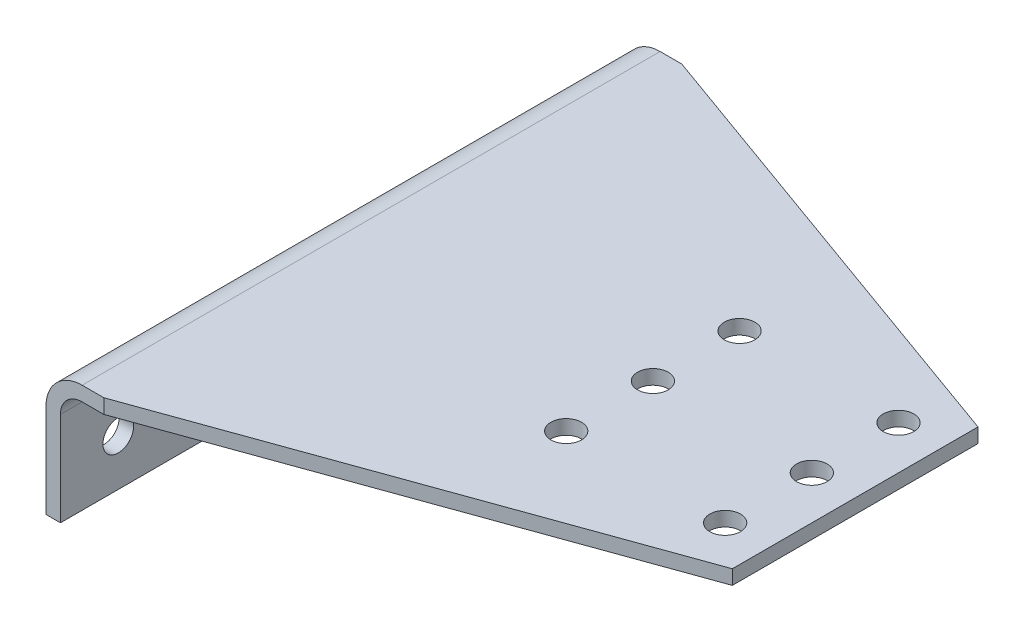
ISO-10303-21;
HEADER;
FILE_DESCRIPTION(('STEP AP214'),'2;1');
FILE_NAME('part.step','',(''),(''),'','','');
FILE_SCHEMA(('AUTOMOTIVE_DESIGN { 1 0 10303 214 1 1 1 1 }'));
ENDSEC;
DATA;
#1=APPLICATION_CONTEXT('core data for automotive mechanical design processes');
#2=APPLICATION_PROTOCOL_DEFINITION('international standard','automotive_design',2000,#1);
#3=PRODUCT_CONTEXT('',#1,'mechanical');
#4=PRODUCT('Part','Part','',(#3));
#5=PRODUCT_RELATED_PRODUCT_CATEGORY('part','',(#4));
#6=PRODUCT_DEFINITION_FORMATION('','',#4);
#7=PRODUCT_DEFINITION_CONTEXT('part definition',#1,'design');
#8=PRODUCT_DEFINITION('design','',#6,#7);
#9=PRODUCT_DEFINITION_SHAPE('','',#8);
#10=(LENGTH_UNIT() NAMED_UNIT(*) SI_UNIT(.MILLI.,.METRE.));
#11=(NAMED_UNIT(*) PLANE_ANGLE_UNIT() SI_UNIT($,.RADIAN.));
#12=(NAMED_UNIT(*) SI_UNIT($,.STERADIAN.) SOLID_ANGLE_UNIT());
#13=UNCERTAINTY_MEASURE_WITH_UNIT(LENGTH_MEASURE(1.E-05),#10,'distance_accuracy_value','');
#14=(GEOMETRIC_REPRESENTATION_CONTEXT(3) GLOBAL_UNCERTAINTY_ASSIGNED_CONTEXT((#13)) GLOBAL_UNIT_ASSIGNED_CONTEXT((#10,
#11,#12)) REPRESENTATION_CONTEXT('',''));
#15=CARTESIAN_POINT('',(0.,0.,0.));
#16=DIRECTION('',(0.,0.,1.));
#17=DIRECTION('',(1.,0.,0.));
#18=AXIS2_PLACEMENT_3D('',#15,#16,#17);
#19=CARTESIAN_POINT('',(6.34999999999997,-57.15,-127.000000000001));
#20=DIRECTION('',(1.,0.,0.));
#21=DIRECTION('',(0.,1.,0.));
#22=AXIS2_PLACEMENT_3D('',#19,#20,#21);
#23=PLANE('',#22);
#24=CARTESIAN_POINT('',(6.34999999999997,-36.5125,50.8000000000006));
#25=DIRECTION('',(1.,0.,0.));
#26=DIRECTION('',(0.,1.,0.));
#27=AXIS2_PLACEMENT_3D('',#24,#25,#26);
#28=CIRCLE('',#27,6.731);
#29=CARTESIAN_POINT('',(6.34999999999997,-29.7815,50.8000000000006));
#30=VERTEX_POINT('',#29);
#31=EDGE_CURVE('E361',#30,#30,#28,.F.);
#32=ORIENTED_EDGE('',*,*,#31,.T.);
#33=EDGE_LOOP('',(#32));
#34=FACE_BOUND('',#33,.T.);
#35=CARTESIAN_POINT('',(6.34999999999997,-36.5125,-101.599999999999));
#36=DIRECTION('',(1.,0.,0.));
#37=DIRECTION('',(0.,1.,0.));
#38=AXIS2_PLACEMENT_3D('',#35,#36,#37);
#39=CIRCLE('',#38,6.73099999999998);
#40=CARTESIAN_POINT('',(6.34999999999997,-29.7815,-101.599999999999));
#41=VERTEX_POINT('',#40);
#42=EDGE_CURVE('E372',#41,#41,#39,.F.);
#43=ORIENTED_EDGE('',*,*,#42,.T.);
#44=EDGE_LOOP('',(#43));
#45=FACE_BOUND('',#44,.T.);
#46=DIRECTION('',(0.,1.,0.));
#47=VECTOR('',#46,1.);
#48=CARTESIAN_POINT('',(6.34999999999997,-57.15,127.000000000001));
#49=LINE('',#48,#47);
#50=CARTESIAN_POINT('',(6.34999999999997,-57.15,127.000000000001));
#51=VERTEX_POINT('',#50);
#52=CARTESIAN_POINT('',(6.34999999999997,-15.875,127.000000000001));
#53=VERTEX_POINT('',#52);
#54=EDGE_CURVE('E198',#51,#53,#49,.T.);
#55=ORIENTED_EDGE('',*,*,#54,.F.);
#56=DIRECTION('',(0.,0.,1.));
#57=VECTOR('',#56,1.);
#58=CARTESIAN_POINT('',(6.34999999999997,-57.15,-127.000000000001));
#59=LINE('',#58,#57);
#60=CARTESIAN_POINT('',(6.34999999999997,-57.15,-127.000000000001));
#61=VERTEX_POINT('',#60);
#62=EDGE_CURVE('E228',#61,#51,#59,.T.);
#63=ORIENTED_EDGE('',*,*,#62,.F.);
#64=DIRECTION('',(0.,1.,0.));
#65=VECTOR('',#64,1.);
#66=CARTESIAN_POINT('',(6.34999999999997,-57.15,-127.000000000001));
#67=LINE('',#66,#65);
#68=CARTESIAN_POINT('',(6.34999999999997,-15.875,-127.000000000001));
#69=VERTEX_POINT('',#68);
#70=EDGE_CURVE('E218',#61,#69,#67,.T.);
#71=ORIENTED_EDGE('',*,*,#70,.T.);
#72=DIRECTION('',(0.,0.,1.));
#73=VECTOR('',#72,1.);
#74=CARTESIAN_POINT('',(6.34999999999997,-15.875,-127.000000000001));
#75=LINE('',#74,#73);
#76=EDGE_CURVE('E226',#69,#53,#75,.T.);
#77=ORIENTED_EDGE('',*,*,#76,.T.);
#78=EDGE_LOOP('',(#55,#63,#71,#77));
#79=FACE_BOUND('',#78,.T.);
#80=CARTESIAN_POINT('',(6.34999999999997,-36.5125,0.));
#81=DIRECTION('',(1.,0.,0.));
#82=DIRECTION('',(0.,1.,0.));
#83=AXIS2_PLACEMENT_3D('',#80,#81,#82);
#84=CIRCLE('',#83,6.731);
#85=CARTESIAN_POINT('',(6.34999999999997,-29.7815,0.));
#86=VERTEX_POINT('',#85);
#87=EDGE_CURVE('E171',#86,#86,#84,.F.);
#88=ORIENTED_EDGE('',*,*,#87,.T.);
#89=EDGE_LOOP('',(#88));
#90=FACE_BOUND('',#89,.T.);
#91=CARTESIAN_POINT('',(6.34999999999997,-36.5125,101.599999999999));
#92=DIRECTION('',(1.,0.,0.));
#93=DIRECTION('',(0.,1.,0.));
#94=AXIS2_PLACEMENT_3D('',#91,#92,#93);
#95=CIRCLE('',#94,6.731);
#96=CARTESIAN_POINT('',(6.34999999999997,-29.7815,101.599999999999));
#97=VERTEX_POINT('',#96);
#98=EDGE_CURVE('E366',#97,#97,#95,.F.);
#99=ORIENTED_EDGE('',*,*,#98,.T.);
#100=EDGE_LOOP('',(#99));
#101=FACE_BOUND('',#100,.T.);
#102=CARTESIAN_POINT('',(6.34999999999997,-36.5125,-50.8000000000006));
#103=DIRECTION('',(1.,0.,0.));
#104=DIRECTION('',(0.,1.,0.));
#105=AXIS2_PLACEMENT_3D('',#102,#103,#104);
#106=CIRCLE('',#105,6.731);
#107=CARTESIAN_POINT('',(6.34999999999997,-29.7815,-50.8000000000006));
#108=VERTEX_POINT('',#107);
#109=EDGE_CURVE('E350',#108,#108,#106,.F.);
#110=ORIENTED_EDGE('',*,*,#109,.T.);
#111=EDGE_LOOP('',(#110));
#112=FACE_BOUND('',#111,.T.);
#113=ADVANCED_FACE('F34',(#34,#45,#79,#90,#101,#112),#23,.T.);
#114=CARTESIAN_POINT('',(0.,-15.875,-127.000000000001));
#115=DIRECTION('',(-1.,0.,0.));
#116=DIRECTION('',(0.,-1.,0.));
#117=AXIS2_PLACEMENT_3D('',#114,#115,#116);
#118=PLANE('',#117);
#119=CARTESIAN_POINT('',(0.,-36.5125,50.8000000000006));
#120=DIRECTION('',(1.,0.,0.));
#121=DIRECTION('',(0.,0.,-1.));
#122=AXIS2_PLACEMENT_3D('',#119,#120,#121);
#123=CIRCLE('',#122,6.731);
#124=CARTESIAN_POINT('',(0.,-36.5125,44.0690000000006));
#125=VERTEX_POINT('',#124);
#126=EDGE_CURVE('E356',#125,#125,#123,.T.);
#127=ORIENTED_EDGE('',*,*,#126,.T.);
#128=EDGE_LOOP('',(#127));
#129=FACE_BOUND('',#128,.T.);
#130=CARTESIAN_POINT('',(0.,-36.5125,-101.599999999999));
#131=DIRECTION('',(1.,0.,0.));
#132=DIRECTION('',(0.,0.,-1.));
#133=AXIS2_PLACEMENT_3D('',#130,#131,#132);
#134=CIRCLE('',#133,6.73099999999998);
#135=CARTESIAN_POINT('',(0.,-36.5125,-108.330999999999));
#136=VERTEX_POINT('',#135);
#137=EDGE_CURVE('E369',#136,#136,#134,.T.);
#138=ORIENTED_EDGE('',*,*,#137,.T.);
#139=EDGE_LOOP('',(#138));
#140=FACE_BOUND('',#139,.T.);
#141=DIRECTION('',(0.,-1.,0.));
#142=VECTOR('',#141,1.);
#143=CARTESIAN_POINT('',(0.,-15.875,127.000000000001));
#144=LINE('',#143,#142);
#145=CARTESIAN_POINT('',(0.,-15.875,127.000000000001));
#146=VERTEX_POINT('',#145);
#147=CARTESIAN_POINT('',(0.,-57.15,127.000000000001));
#148=VERTEX_POINT('',#147);
#149=EDGE_CURVE('E192',#146,#148,#144,.T.);
#150=ORIENTED_EDGE('',*,*,#149,.F.);
#151=DIRECTION('',(0.,0.,1.));
#152=VECTOR('',#151,1.);
#153=CARTESIAN_POINT('',(0.,-15.875,-127.000000000001));
#154=LINE('',#153,#152);
#155=CARTESIAN_POINT('',(0.,-15.875,-127.000000000001));
#156=VERTEX_POINT('',#155);
#157=EDGE_CURVE('E135',#156,#146,#154,.T.);
#158=ORIENTED_EDGE('',*,*,#157,.F.);
#159=DIRECTION('',(0.,-1.,0.));
#160=VECTOR('',#159,1.);
#161=CARTESIAN_POINT('',(0.,-15.875,-127.000000000001));
#162=LINE('',#161,#160);
#163=CARTESIAN_POINT('',(0.,-57.15,-127.000000000001));
#164=VERTEX_POINT('',#163);
#165=EDGE_CURVE('E212',#156,#164,#162,.T.);
#166=ORIENTED_EDGE('',*,*,#165,.T.);
#167=DIRECTION('',(0.,0.,1.));
#168=VECTOR('',#167,1.);
#169=CARTESIAN_POINT('',(0.,-57.15,-127.000000000001));
#170=LINE('',#169,#168);
#171=EDGE_CURVE('E230',#164,#148,#170,.T.);
#172=ORIENTED_EDGE('',*,*,#171,.T.);
#173=EDGE_LOOP('',(#150,#158,#166,#172));
#174=FACE_BOUND('',#173,.T.);
#175=CARTESIAN_POINT('',(0.,-36.5125,0.));
#176=DIRECTION('',(1.,0.,0.));
#177=DIRECTION('',(0.,0.,-1.));
#178=AXIS2_PLACEMENT_3D('',#175,#176,#177);
#179=CIRCLE('',#178,6.731);
#180=CARTESIAN_POINT('',(0.,-36.5125,-6.731));
#181=VERTEX_POINT('',#180);
#182=EDGE_CURVE('E374',#181,#181,#179,.T.);
#183=ORIENTED_EDGE('',*,*,#182,.T.);
#184=EDGE_LOOP('',(#183));
#185=FACE_BOUND('',#184,.T.);
#186=CARTESIAN_POINT('',(0.,-36.5125,101.599999999999));
#187=DIRECTION('',(1.,0.,0.));
#188=DIRECTION('',(0.,0.,-1.));
#189=AXIS2_PLACEMENT_3D('',#186,#187,#188);
#190=CIRCLE('',#189,6.731);
#191=CARTESIAN_POINT('',(0.,-36.5125,94.8689999999995));
#192=VERTEX_POINT('',#191);
#193=EDGE_CURVE('E363',#192,#192,#190,.T.);
#194=ORIENTED_EDGE('',*,*,#193,.T.);
#195=EDGE_LOOP('',(#194));
#196=FACE_BOUND('',#195,.T.);
#197=CARTESIAN_POINT('',(0.,-36.5125,-50.8000000000006));
#198=DIRECTION('',(1.,0.,0.));
#199=DIRECTION('',(0.,0.,-1.));
#200=AXIS2_PLACEMENT_3D('',#197,#198,#199);
#201=CIRCLE('',#200,6.731);
#202=CARTESIAN_POINT('',(0.,-36.5125,-57.5310000000006));
#203=VERTEX_POINT('',#202);
#204=EDGE_CURVE('E353',#203,#203,#201,.T.);
#205=ORIENTED_EDGE('',*,*,#204,.T.);
#206=EDGE_LOOP('',(#205));
#207=FACE_BOUND('',#206,.T.);
#208=ADVANCED_FACE('F239',(#129,#140,#174,#185,#196,#207),#118,.T.);
#209=CARTESIAN_POINT('',(15.875,-6.34999999999999,-127.000000000001));
#210=DIRECTION('',(0.,-1.,0.));
#211=DIRECTION('',(1.,0.,0.));
#212=AXIS2_PLACEMENT_3D('',#209,#210,#211);
#213=PLANE('',#212);
#214=CARTESIAN_POINT('',(139.700000000001,-6.34999999999997,38.1));
#215=DIRECTION('',(0.,-1.,0.));
#216=DIRECTION('',(1.,0.,0.));
#217=AXIS2_PLACEMENT_3D('',#214,#215,#216);
#218=CIRCLE('',#217,6.73099999999998);
#219=CARTESIAN_POINT('',(146.431000000001,-6.34999999999997,38.1));
#220=VERTEX_POINT('',#219);
#221=EDGE_CURVE('E158',#220,#220,#218,.F.);
#222=ORIENTED_EDGE('',*,*,#221,.T.);
#223=EDGE_LOOP('',(#222));
#224=FACE_BOUND('',#223,.T.);
#225=CARTESIAN_POINT('',(139.700000000001,-6.34999999999997,0.));
#226=DIRECTION('',(0.,-1.,0.));
#227=DIRECTION('',(1.,0.,0.));
#228=AXIS2_PLACEMENT_3D('',#225,#226,#227);
#229=CIRCLE('',#228,6.73099999999998);
#230=CARTESIAN_POINT('',(146.431000000001,-6.34999999999997,0.));
#231=VERTEX_POINT('',#230);
#232=EDGE_CURVE('E151',#231,#231,#229,.F.);
#233=ORIENTED_EDGE('',*,*,#232,.T.);
#234=EDGE_LOOP('',(#233));
#235=FACE_BOUND('',#234,.T.);
#236=CARTESIAN_POINT('',(209.550000000001,-6.34999999999998,-38.1));
#237=DIRECTION('',(0.,-1.,0.));
#238=DIRECTION('',(1.,0.,0.));
#239=AXIS2_PLACEMENT_3D('',#236,#237,#238);
#240=CIRCLE('',#239,6.73099999999998);
#241=CARTESIAN_POINT('',(216.281000000001,-6.34999999999998,-38.1));
#242=VERTEX_POINT('',#241);
#243=EDGE_CURVE('E118',#242,#242,#240,.F.);
#244=ORIENTED_EDGE('',*,*,#243,.T.);
#245=EDGE_LOOP('',(#244));
#246=FACE_BOUND('',#245,.T.);
#247=DIRECTION('',(0.,0.,1.));
#248=VECTOR('',#247,1.);
#249=CARTESIAN_POINT('',(228.600000000001,-6.35000000000003,-127.000000000001));
#250=LINE('',#249,#248);
#251=CARTESIAN_POINT('',(228.600000000001,-6.35,-53.9749999999994));
#252=VERTEX_POINT('',#251);
#253=CARTESIAN_POINT('',(228.600000000001,-6.35,53.9749999999994));
#254=VERTEX_POINT('',#253);
#255=EDGE_CURVE('E142',#252,#254,#250,.T.);
#256=ORIENTED_EDGE('',*,*,#255,.T.);
#257=DIRECTION('',(-0.941074716280077,0.,0.338198726163152));
#258=VECTOR('',#257,1.);
#259=CARTESIAN_POINT('',(97.8051027027033,-6.35000000000003,100.979416216216));
#260=LINE('',#259,#258);
#261=CARTESIAN_POINT('',(25.4,-6.34999999999997,127.000000000001));
#262=VERTEX_POINT('',#261);
#263=EDGE_CURVE('E113',#254,#262,#260,.T.);
#264=ORIENTED_EDGE('',*,*,#263,.T.);
#265=DIRECTION('',(1.,0.,0.));
#266=VECTOR('',#265,1.);
#267=CARTESIAN_POINT('',(15.875,-6.34999999999999,127.000000000001));
#268=LINE('',#267,#266);
#269=CARTESIAN_POINT('',(15.875,-6.34999999999999,127.000000000001));
#270=VERTEX_POINT('',#269);
#271=EDGE_CURVE('E204',#270,#262,#268,.T.);
#272=ORIENTED_EDGE('',*,*,#271,.F.);
#273=DIRECTION('',(0.,0.,1.));
#274=VECTOR('',#273,1.);
#275=CARTESIAN_POINT('',(15.875,-6.34999999999999,-127.000000000001));
#276=LINE('',#275,#274);
#277=CARTESIAN_POINT('',(15.875,-6.34999999999999,-127.000000000001));
#278=VERTEX_POINT('',#277);
#279=EDGE_CURVE('E224',#278,#270,#276,.T.);
#280=ORIENTED_EDGE('',*,*,#279,.F.);
#281=DIRECTION('',(1.,0.,0.));
#282=VECTOR('',#281,1.);
#283=CARTESIAN_POINT('',(15.875,-6.34999999999999,-127.000000000001));
#284=LINE('',#283,#282);
#285=CARTESIAN_POINT('',(25.4,-6.35,-127.000000000001));
#286=VERTEX_POINT('',#285);
#287=EDGE_CURVE('E133',#278,#286,#284,.T.);
#288=ORIENTED_EDGE('',*,*,#287,.T.);
#289=DIRECTION('',(0.941074716280077,0.,0.338198726163152));
#290=VECTOR('',#289,1.);
#291=CARTESIAN_POINT('',(16.9644540540541,-6.34999999999999,-130.031524324325));
#292=LINE('',#291,#290);
#293=EDGE_CURVE('E58',#286,#252,#292,.T.);
#294=ORIENTED_EDGE('',*,*,#293,.T.);
#295=EDGE_LOOP('',(#256,#264,#272,#280,#288,#294));
#296=FACE_BOUND('',#295,.T.);
#297=CARTESIAN_POINT('',(209.550000000001,-6.34999999999998,0.));
#298=DIRECTION('',(0.,-1.,0.));
#299=DIRECTION('',(1.,0.,0.));
#300=AXIS2_PLACEMENT_3D('',#297,#298,#299);
#301=CIRCLE('',#300,6.73099999999998);
#302=CARTESIAN_POINT('',(216.281000000001,-6.34999999999998,0.));
#303=VERTEX_POINT('',#302);
#304=EDGE_CURVE('E147',#303,#303,#301,.F.);
#305=ORIENTED_EDGE('',*,*,#304,.T.);
#306=EDGE_LOOP('',(#305));
#307=FACE_BOUND('',#306,.T.);
#308=CARTESIAN_POINT('',(139.700000000001,-6.34999999999997,-38.1));
#309=DIRECTION('',(0.,-1.,0.));
#310=DIRECTION('',(1.,0.,0.));
#311=AXIS2_PLACEMENT_3D('',#308,#309,#310);
#312=CIRCLE('',#311,6.73099999999998);
#313=CARTESIAN_POINT('',(146.431000000001,-6.34999999999997,-38.1));
#314=VERTEX_POINT('',#313);
#315=EDGE_CURVE('E155',#314,#314,#312,.F.);
#316=ORIENTED_EDGE('',*,*,#315,.T.);
#317=EDGE_LOOP('',(#316));
#318=FACE_BOUND('',#317,.T.);
#319=CARTESIAN_POINT('',(209.550000000001,-6.34999999999998,38.1));
#320=DIRECTION('',(0.,-1.,0.));
#321=DIRECTION('',(1.,0.,0.));
#322=AXIS2_PLACEMENT_3D('',#319,#320,#321);
#323=CIRCLE('',#322,6.73099999999998);
#324=CARTESIAN_POINT('',(216.281000000001,-6.34999999999998,38.1));
#325=VERTEX_POINT('',#324);
#326=EDGE_CURVE('E161',#325,#325,#323,.F.);
#327=ORIENTED_EDGE('',*,*,#326,.T.);
#328=EDGE_LOOP('',(#327));
#329=FACE_BOUND('',#328,.T.);
#330=ADVANCED_FACE('F261',(#224,#235,#246,#296,#307,#318,#329),#213,.T.);
#331=CARTESIAN_POINT('',(228.600000000001,0.,-127.000000000001));
#332=DIRECTION('',(0.,1.,0.));
#333=DIRECTION('',(-1.,0.,0.));
#334=AXIS2_PLACEMENT_3D('',#331,#332,#333);
#335=PLANE('',#334);
#336=CARTESIAN_POINT('',(139.700000000001,0.,38.1));
#337=DIRECTION('',(0.,1.,0.));
#338=DIRECTION('',(-1.,0.,0.));
#339=AXIS2_PLACEMENT_3D('',#336,#337,#338);
#340=CIRCLE('',#339,6.73099999999998);
#341=CARTESIAN_POINT('',(132.969000000001,0.,38.1));
#342=VERTEX_POINT('',#341);
#343=EDGE_CURVE('E159',#342,#342,#340,.F.);
#344=ORIENTED_EDGE('',*,*,#343,.T.);
#345=EDGE_LOOP('',(#344));
#346=FACE_BOUND('',#345,.T.);
#347=CARTESIAN_POINT('',(139.700000000001,0.,0.));
#348=DIRECTION('',(0.,1.,0.));
#349=DIRECTION('',(-1.,0.,0.));
#350=AXIS2_PLACEMENT_3D('',#347,#348,#349);
#351=CIRCLE('',#350,6.73099999999998);
#352=CARTESIAN_POINT('',(132.969000000001,0.,0.));
#353=VERTEX_POINT('',#352);
#354=EDGE_CURVE('E152',#353,#353,#351,.F.);
#355=ORIENTED_EDGE('',*,*,#354,.T.);
#356=EDGE_LOOP('',(#355));
#357=FACE_BOUND('',#356,.T.);
#358=CARTESIAN_POINT('',(209.550000000001,0.,-38.1));
#359=DIRECTION('',(0.,1.,0.));
#360=DIRECTION('',(-1.,0.,0.));
#361=AXIS2_PLACEMENT_3D('',#358,#359,#360);
#362=CIRCLE('',#361,6.73099999999998);
#363=CARTESIAN_POINT('',(202.819000000001,0.,-38.1));
#364=VERTEX_POINT('',#363);
#365=EDGE_CURVE('E144',#364,#364,#362,.F.);
#366=ORIENTED_EDGE('',*,*,#365,.T.);
#367=EDGE_LOOP('',(#366));
#368=FACE_BOUND('',#367,.T.);
#369=DIRECTION('',(-1.,0.,0.));
#370=VECTOR('',#369,1.);
#371=CARTESIAN_POINT('',(228.600000000001,0.,127.000000000001));
#372=LINE('',#371,#370);
#373=CARTESIAN_POINT('',(25.4,0.,127.000000000001));
#374=VERTEX_POINT('',#373);
#375=CARTESIAN_POINT('',(15.875,0.,127.000000000001));
#376=VERTEX_POINT('',#375);
#377=EDGE_CURVE('E128',#374,#376,#372,.T.);
#378=ORIENTED_EDGE('',*,*,#377,.F.);
#379=DIRECTION('',(0.941074716280077,0.,-0.338198726163152));
#380=VECTOR('',#379,1.);
#381=CARTESIAN_POINT('',(286.198962162163,0.,33.2753729729731));
#382=LINE('',#381,#380);
#383=CARTESIAN_POINT('',(228.600000000001,0.,53.9749999999994));
#384=VERTEX_POINT('',#383);
#385=EDGE_CURVE('E51',#374,#384,#382,.T.);
#386=ORIENTED_EDGE('',*,*,#385,.T.);
#387=DIRECTION('',(0.,0.,1.));
#388=VECTOR('',#387,1.);
#389=CARTESIAN_POINT('',(228.600000000001,0.,-127.000000000001));
#390=LINE('',#389,#388);
#391=CARTESIAN_POINT('',(228.600000000001,0.,-53.9749999999994));
#392=VERTEX_POINT('',#391);
#393=EDGE_CURVE('E126',#392,#384,#390,.T.);
#394=ORIENTED_EDGE('',*,*,#393,.F.);
#395=DIRECTION('',(-0.941074716280077,0.,-0.338198726163152));
#396=VECTOR('',#395,1.);
#397=CARTESIAN_POINT('',(205.358313513514,0.,-62.3274810810823));
#398=LINE('',#397,#396);
#399=CARTESIAN_POINT('',(25.4,0.,-127.000000000001));
#400=VERTEX_POINT('',#399);
#401=EDGE_CURVE('E185',#392,#400,#398,.T.);
#402=ORIENTED_EDGE('',*,*,#401,.T.);
#403=DIRECTION('',(-1.,0.,0.));
#404=VECTOR('',#403,1.);
#405=CARTESIAN_POINT('',(228.600000000001,0.,-127.000000000001));
#406=LINE('',#405,#404);
#407=CARTESIAN_POINT('',(15.875,0.,-127.000000000001));
#408=VERTEX_POINT('',#407);
#409=EDGE_CURVE('E207',#400,#408,#406,.T.);
#410=ORIENTED_EDGE('',*,*,#409,.T.);
#411=DIRECTION('',(0.,0.,1.));
#412=VECTOR('',#411,1.);
#413=CARTESIAN_POINT('',(15.875,0.,-127.000000000001));
#414=LINE('',#413,#412);
#415=EDGE_CURVE('E132',#408,#376,#414,.T.);
#416=ORIENTED_EDGE('',*,*,#415,.T.);
#417=EDGE_LOOP('',(#378,#386,#394,#402,#410,#416));
#418=FACE_BOUND('',#417,.T.);
#419=CARTESIAN_POINT('',(209.550000000001,0.,0.));
#420=DIRECTION('',(0.,1.,0.));
#421=DIRECTION('',(-1.,0.,0.));
#422=AXIS2_PLACEMENT_3D('',#419,#420,#421);
#423=CIRCLE('',#422,6.73099999999998);
#424=CARTESIAN_POINT('',(202.819000000001,0.,0.));
#425=VERTEX_POINT('',#424);
#426=EDGE_CURVE('E148',#425,#425,#423,.F.);
#427=ORIENTED_EDGE('',*,*,#426,.T.);
#428=EDGE_LOOP('',(#427));
#429=FACE_BOUND('',#428,.T.);
#430=CARTESIAN_POINT('',(139.700000000001,0.,-38.1));
#431=DIRECTION('',(0.,1.,0.));
#432=DIRECTION('',(-1.,0.,0.));
#433=AXIS2_PLACEMENT_3D('',#430,#431,#432);
#434=CIRCLE('',#433,6.73099999999998);
#435=CARTESIAN_POINT('',(132.969000000001,0.,-38.1));
#436=VERTEX_POINT('',#435);
#437=EDGE_CURVE('E156',#436,#436,#434,.F.);
#438=ORIENTED_EDGE('',*,*,#437,.T.);
#439=EDGE_LOOP('',(#438));
#440=FACE_BOUND('',#439,.T.);
#441=CARTESIAN_POINT('',(209.550000000001,0.,38.1));
#442=DIRECTION('',(0.,1.,0.));
#443=DIRECTION('',(-1.,0.,0.));
#444=AXIS2_PLACEMENT_3D('',#441,#442,#443);
#445=CIRCLE('',#444,6.73099999999998);
#446=CARTESIAN_POINT('',(202.819000000001,0.,38.1));
#447=VERTEX_POINT('',#446);
#448=EDGE_CURVE('E38',#447,#447,#445,.F.);
#449=ORIENTED_EDGE('',*,*,#448,.T.);
#450=EDGE_LOOP('',(#449));
#451=FACE_BOUND('',#450,.T.);
#452=ADVANCED_FACE('F123',(#346,#357,#368,#418,#429,#440,#451),#335,.T.);
#453=CARTESIAN_POINT('',(228.600000000001,-6.35000000000003,-127.000000000001));
#454=DIRECTION('',(1.,0.,0.));
#455=DIRECTION('',(0.,0.,-1.));
#456=AXIS2_PLACEMENT_3D('',#453,#454,#455);
#457=PLANE('',#456);
#458=ORIENTED_EDGE('',*,*,#393,.T.);
#459=DIRECTION('',(0.,-1.,0.));
#460=VECTOR('',#459,1.);
#461=CARTESIAN_POINT('',(228.600000000001,508.,53.9749999999994));
#462=LINE('',#461,#460);
#463=EDGE_CURVE('E110',#384,#254,#462,.T.);
#464=ORIENTED_EDGE('',*,*,#463,.T.);
#465=ORIENTED_EDGE('',*,*,#255,.F.);
#466=DIRECTION('',(0.,-1.,0.));
#467=VECTOR('',#466,1.);
#468=CARTESIAN_POINT('',(228.600000000001,508.,-53.9749999999994));
#469=LINE('',#468,#467);
#470=EDGE_CURVE('E131',#392,#252,#469,.T.);
#471=ORIENTED_EDGE('',*,*,#470,.F.);
#472=EDGE_LOOP('',(#458,#464,#465,#471));
#473=FACE_BOUND('',#472,.T.);
#474=ADVANCED_FACE('F36',(#473),#457,.T.);
#475=CARTESIAN_POINT('',(15.875,-15.875,127.000000000001));
#476=DIRECTION('',(0.,0.,1.));
#477=DIRECTION('',(1.,0.,0.));
#478=AXIS2_PLACEMENT_3D('',#475,#476,#477);
#479=PLANE('',#478);
#480=ORIENTED_EDGE('',*,*,#271,.T.);
#481=DIRECTION('',(0.,1.,0.));
#482=VECTOR('',#481,1.);
#483=CARTESIAN_POINT('',(25.4,-15.875,127.000000000001));
#484=LINE('',#483,#482);
#485=EDGE_CURVE('E11',#262,#374,#484,.T.);
#486=ORIENTED_EDGE('',*,*,#485,.T.);
#487=ORIENTED_EDGE('',*,*,#377,.T.);
#488=CARTESIAN_POINT('',(15.875,-15.875,127.000000000001));
#489=DIRECTION('',(0.,0.,1.));
#490=DIRECTION('',(1.,0.,0.));
#491=AXIS2_PLACEMENT_3D('',#488,#489,#490);
#492=CIRCLE('',#491,15.875);
#493=EDGE_CURVE('E189',#376,#146,#492,.T.);
#494=ORIENTED_EDGE('',*,*,#493,.T.);
#495=ORIENTED_EDGE('',*,*,#149,.T.);
#496=DIRECTION('',(1.,0.,0.));
#497=VECTOR('',#496,1.);
#498=CARTESIAN_POINT('',(0.,-57.15,127.000000000001));
#499=LINE('',#498,#497);
#500=EDGE_CURVE('E195',#148,#51,#499,.T.);
#501=ORIENTED_EDGE('',*,*,#500,.T.);
#502=ORIENTED_EDGE('',*,*,#54,.T.);
#503=CARTESIAN_POINT('',(15.875,-15.875,127.000000000001));
#504=DIRECTION('',(0.,0.,-1.));
#505=DIRECTION('',(-1.,0.,0.));
#506=AXIS2_PLACEMENT_3D('',#503,#504,#505);
#507=CIRCLE('',#506,9.525);
#508=EDGE_CURVE('E201',#53,#270,#507,.T.);
#509=ORIENTED_EDGE('',*,*,#508,.T.);
#510=EDGE_LOOP('',(#480,#486,#487,#494,#495,#501,#502,#509));
#511=FACE_BOUND('',#510,.T.);
#512=ADVANCED_FACE('F243',(#511),#479,.T.);
#513=CARTESIAN_POINT('',(15.875,-15.875,-127.000000000001));
#514=DIRECTION('',(0.,0.,1.));
#515=DIRECTION('',(1.,0.,0.));
#516=AXIS2_PLACEMENT_3D('',#513,#514,#515);
#517=PLANE('',#516);
#518=DIRECTION('',(0.,1.,0.));
#519=VECTOR('',#518,1.);
#520=CARTESIAN_POINT('',(25.4,-15.875,-127.000000000001));
#521=LINE('',#520,#519);
#522=EDGE_CURVE('E43',#286,#400,#521,.T.);
#523=ORIENTED_EDGE('',*,*,#522,.F.);
#524=ORIENTED_EDGE('',*,*,#287,.F.);
#525=CARTESIAN_POINT('',(15.875,-15.875,-127.000000000001));
#526=DIRECTION('',(0.,0.,-1.));
#527=DIRECTION('',(-1.,0.,0.));
#528=AXIS2_PLACEMENT_3D('',#525,#526,#527);
#529=CIRCLE('',#528,9.525);
#530=EDGE_CURVE('E138',#69,#278,#529,.T.);
#531=ORIENTED_EDGE('',*,*,#530,.F.);
#532=ORIENTED_EDGE('',*,*,#70,.F.);
#533=DIRECTION('',(1.,0.,0.));
#534=VECTOR('',#533,1.);
#535=CARTESIAN_POINT('',(0.,-57.15,-127.000000000001));
#536=LINE('',#535,#534);
#537=EDGE_CURVE('E215',#164,#61,#536,.T.);
#538=ORIENTED_EDGE('',*,*,#537,.F.);
#539=ORIENTED_EDGE('',*,*,#165,.F.);
#540=CARTESIAN_POINT('',(15.875,-15.875,-127.000000000001));
#541=DIRECTION('',(0.,0.,1.));
#542=DIRECTION('',(1.,0.,0.));
#543=AXIS2_PLACEMENT_3D('',#540,#541,#542);
#544=CIRCLE('',#543,15.875);
#545=EDGE_CURVE('E209',#408,#156,#544,.T.);
#546=ORIENTED_EDGE('',*,*,#545,.F.);
#547=ORIENTED_EDGE('',*,*,#409,.F.);
#548=EDGE_LOOP('',(#523,#524,#531,#532,#538,#539,#546,#547));
#549=FACE_BOUND('',#548,.T.);
#550=ADVANCED_FACE('F246',(#549),#517,.F.);
#551=CARTESIAN_POINT('',(15.875,-15.875,-127.000000000001));
#552=DIRECTION('',(0.,0.,1.));
#553=DIRECTION('',(1.,0.,0.));
#554=AXIS2_PLACEMENT_3D('',#551,#552,#553);
#555=CYLINDRICAL_SURFACE('',#554,9.525);
#556=ORIENTED_EDGE('',*,*,#508,.F.);
#557=ORIENTED_EDGE('',*,*,#76,.F.);
#558=ORIENTED_EDGE('',*,*,#530,.T.);
#559=ORIENTED_EDGE('',*,*,#279,.T.);
#560=EDGE_LOOP('',(#556,#557,#558,#559));
#561=FACE_BOUND('',#560,.T.);
#562=ADVANCED_FACE('F258',(#561),#555,.F.);
#563=CARTESIAN_POINT('',(0.,-57.15,-127.000000000001));
#564=DIRECTION('',(0.,-1.,0.));
#565=DIRECTION('',(0.,0.,-1.));
#566=AXIS2_PLACEMENT_3D('',#563,#564,#565);
#567=PLANE('',#566);
#568=ORIENTED_EDGE('',*,*,#500,.F.);
#569=ORIENTED_EDGE('',*,*,#171,.F.);
#570=ORIENTED_EDGE('',*,*,#537,.T.);
#571=ORIENTED_EDGE('',*,*,#62,.T.);
#572=EDGE_LOOP('',(#568,#569,#570,#571));
#573=FACE_BOUND('',#572,.T.);
#574=ADVANCED_FACE('F251',(#573),#567,.T.);
#575=CARTESIAN_POINT('',(15.875,-15.875,-127.000000000001));
#576=DIRECTION('',(0.,0.,1.));
#577=DIRECTION('',(1.,0.,0.));
#578=AXIS2_PLACEMENT_3D('',#575,#576,#577);
#579=CYLINDRICAL_SURFACE('',#578,15.875);
#580=ORIENTED_EDGE('',*,*,#493,.F.);
#581=ORIENTED_EDGE('',*,*,#415,.F.);
#582=ORIENTED_EDGE('',*,*,#545,.T.);
#583=ORIENTED_EDGE('',*,*,#157,.T.);
#584=EDGE_LOOP('',(#580,#581,#582,#583));
#585=FACE_BOUND('',#584,.T.);
#586=ADVANCED_FACE('F234',(#585),#579,.T.);
#587=CARTESIAN_POINT('',(25.3999999999999,508.,-127.000000000001));
#588=DIRECTION('',(0.338198726163152,0.,-0.941074716280074));
#589=DIRECTION('',(-0.941074716280077,0.,-0.338198726163152));
#590=AXIS2_PLACEMENT_3D('',#587,#588,#589);
#591=PLANE('',#590);
#592=ORIENTED_EDGE('',*,*,#522,.T.);
#593=ORIENTED_EDGE('',*,*,#401,.F.);
#594=ORIENTED_EDGE('',*,*,#470,.T.);
#595=ORIENTED_EDGE('',*,*,#293,.F.);
#596=EDGE_LOOP('',(#592,#593,#594,#595));
#597=FACE_BOUND('',#596,.T.);
#598=ADVANCED_FACE('F263',(#597),#591,.T.);
#599=CARTESIAN_POINT('',(25.3999999999999,508.,127.000000000001));
#600=DIRECTION('',(0.338198726163152,0.,0.941074716280074));
#601=DIRECTION('',(0.941074716280077,0.,-0.338198726163152));
#602=AXIS2_PLACEMENT_3D('',#599,#600,#601);
#603=PLANE('',#602);
#604=ORIENTED_EDGE('',*,*,#463,.F.);
#605=ORIENTED_EDGE('',*,*,#385,.F.);
#606=ORIENTED_EDGE('',*,*,#485,.F.);
#607=ORIENTED_EDGE('',*,*,#263,.F.);
#608=EDGE_LOOP('',(#604,#605,#606,#607));
#609=FACE_BOUND('',#608,.T.);
#610=ADVANCED_FACE('F111',(#609),#603,.T.);
#611=CARTESIAN_POINT('',(209.550000000001,508.,-38.1));
#612=DIRECTION('',(0.,-1.,0.));
#613=DIRECTION('',(0.,0.,-1.));
#614=AXIS2_PLACEMENT_3D('',#611,#612,#613);
#615=CYLINDRICAL_SURFACE('',#614,6.73099999999998);
#616=ORIENTED_EDGE('',*,*,#243,.F.);
#617=EDGE_LOOP('',(#616));
#618=FACE_BOUND('',#617,.T.);
#619=ORIENTED_EDGE('',*,*,#365,.F.);
#620=EDGE_LOOP('',(#619));
#621=FACE_BOUND('',#620,.T.);
#622=ADVANCED_FACE('F270',(#618,#621),#615,.F.);
#623=CARTESIAN_POINT('',(209.550000000001,508.,0.));
#624=DIRECTION('',(0.,-1.,0.));
#625=DIRECTION('',(0.,0.,-1.));
#626=AXIS2_PLACEMENT_3D('',#623,#624,#625);
#627=CYLINDRICAL_SURFACE('',#626,6.73099999999998);
#628=ORIENTED_EDGE('',*,*,#304,.F.);
#629=EDGE_LOOP('',(#628));
#630=FACE_BOUND('',#629,.T.);
#631=ORIENTED_EDGE('',*,*,#426,.F.);
#632=EDGE_LOOP('',(#631));
#633=FACE_BOUND('',#632,.T.);
#634=ADVANCED_FACE('F300',(#630,#633),#627,.F.);
#635=CARTESIAN_POINT('',(139.7,508.,0.));
#636=DIRECTION('',(0.,-1.,0.));
#637=DIRECTION('',(0.,0.,-1.));
#638=AXIS2_PLACEMENT_3D('',#635,#636,#637);
#639=CYLINDRICAL_SURFACE('',#638,6.73099999999998);
#640=ORIENTED_EDGE('',*,*,#232,.F.);
#641=EDGE_LOOP('',(#640));
#642=FACE_BOUND('',#641,.T.);
#643=ORIENTED_EDGE('',*,*,#354,.F.);
#644=EDGE_LOOP('',(#643));
#645=FACE_BOUND('',#644,.T.);
#646=ADVANCED_FACE('F306',(#642,#645),#639,.F.);
#647=CARTESIAN_POINT('',(139.7,508.,-38.1));
#648=DIRECTION('',(0.,-1.,0.));
#649=DIRECTION('',(0.,0.,-1.));
#650=AXIS2_PLACEMENT_3D('',#647,#648,#649);
#651=CYLINDRICAL_SURFACE('',#650,6.73099999999998);
#652=ORIENTED_EDGE('',*,*,#315,.F.);
#653=EDGE_LOOP('',(#652));
#654=FACE_BOUND('',#653,.T.);
#655=ORIENTED_EDGE('',*,*,#437,.F.);
#656=EDGE_LOOP('',(#655));
#657=FACE_BOUND('',#656,.T.);
#658=ADVANCED_FACE('F313',(#654,#657),#651,.F.);
#659=CARTESIAN_POINT('',(139.7,508.,38.1));
#660=DIRECTION('',(0.,-1.,0.));
#661=DIRECTION('',(0.,0.,-1.));
#662=AXIS2_PLACEMENT_3D('',#659,#660,#661);
#663=CYLINDRICAL_SURFACE('',#662,6.73099999999998);
#664=ORIENTED_EDGE('',*,*,#221,.F.);
#665=EDGE_LOOP('',(#664));
#666=FACE_BOUND('',#665,.T.);
#667=ORIENTED_EDGE('',*,*,#343,.F.);
#668=EDGE_LOOP('',(#667));
#669=FACE_BOUND('',#668,.T.);
#670=ADVANCED_FACE('F317',(#666,#669),#663,.F.);
#671=CARTESIAN_POINT('',(209.550000000001,508.,38.1));
#672=DIRECTION('',(0.,-1.,0.));
#673=DIRECTION('',(0.,0.,-1.));
#674=AXIS2_PLACEMENT_3D('',#671,#672,#673);
#675=CYLINDRICAL_SURFACE('',#674,6.73099999999998);
#676=ORIENTED_EDGE('',*,*,#326,.F.);
#677=EDGE_LOOP('',(#676));
#678=FACE_BOUND('',#677,.T.);
#679=ORIENTED_EDGE('',*,*,#448,.F.);
#680=EDGE_LOOP('',(#679));
#681=FACE_BOUND('',#680,.T.);
#682=ADVANCED_FACE('F321',(#678,#681),#675,.F.);
#683=CARTESIAN_POINT('',(228.600000000001,-36.5125,0.));
#684=DIRECTION('',(-1.,0.,0.));
#685=DIRECTION('',(0.,0.,1.));
#686=AXIS2_PLACEMENT_3D('',#683,#684,#685);
#687=CYLINDRICAL_SURFACE('',#686,6.731);
#688=ORIENTED_EDGE('',*,*,#87,.F.);
#689=EDGE_LOOP('',(#688));
#690=FACE_BOUND('',#689,.T.);
#691=ORIENTED_EDGE('',*,*,#182,.F.);
#692=EDGE_LOOP('',(#691));
#693=FACE_BOUND('',#692,.T.);
#694=ADVANCED_FACE('F325',(#690,#693),#687,.F.);
#695=CARTESIAN_POINT('',(228.600000000001,-36.5125,-101.599999999999));
#696=DIRECTION('',(-1.,0.,0.));
#697=DIRECTION('',(0.,0.,1.));
#698=AXIS2_PLACEMENT_3D('',#695,#696,#697);
#699=CYLINDRICAL_SURFACE('',#698,6.73099999999998);
#700=ORIENTED_EDGE('',*,*,#42,.F.);
#701=EDGE_LOOP('',(#700));
#702=FACE_BOUND('',#701,.T.);
#703=ORIENTED_EDGE('',*,*,#137,.F.);
#704=EDGE_LOOP('',(#703));
#705=FACE_BOUND('',#704,.T.);
#706=ADVANCED_FACE('F329',(#702,#705),#699,.F.);
#707=CARTESIAN_POINT('',(228.600000000001,-36.5124999999999,101.599999999999));
#708=DIRECTION('',(-1.,0.,0.));
#709=DIRECTION('',(0.,0.,1.));
#710=AXIS2_PLACEMENT_3D('',#707,#708,#709);
#711=CYLINDRICAL_SURFACE('',#710,6.731);
#712=ORIENTED_EDGE('',*,*,#98,.F.);
#713=EDGE_LOOP('',(#712));
#714=FACE_BOUND('',#713,.T.);
#715=ORIENTED_EDGE('',*,*,#193,.F.);
#716=EDGE_LOOP('',(#715));
#717=FACE_BOUND('',#716,.T.);
#718=ADVANCED_FACE('F333',(#714,#717),#711,.F.);
#719=CARTESIAN_POINT('',(228.600000000001,-36.5125,50.8000000000006));
#720=DIRECTION('',(-1.,0.,0.));
#721=DIRECTION('',(0.,0.,1.));
#722=AXIS2_PLACEMENT_3D('',#719,#720,#721);
#723=CYLINDRICAL_SURFACE('',#722,6.731);
#724=ORIENTED_EDGE('',*,*,#31,.F.);
#725=EDGE_LOOP('',(#724));
#726=FACE_BOUND('',#725,.T.);
#727=ORIENTED_EDGE('',*,*,#126,.F.);
#728=EDGE_LOOP('',(#727));
#729=FACE_BOUND('',#728,.T.);
#730=ADVANCED_FACE('F337',(#726,#729),#723,.F.);
#731=CARTESIAN_POINT('',(228.600000000001,-36.5125,-50.8000000000006));
#732=DIRECTION('',(-1.,0.,0.));
#733=DIRECTION('',(0.,0.,1.));
#734=AXIS2_PLACEMENT_3D('',#731,#732,#733);
#735=CYLINDRICAL_SURFACE('',#734,6.731);
#736=ORIENTED_EDGE('',*,*,#109,.F.);
#737=EDGE_LOOP('',(#736));
#738=FACE_BOUND('',#737,.T.);
#739=ORIENTED_EDGE('',*,*,#204,.F.);
#740=EDGE_LOOP('',(#739));
#741=FACE_BOUND('',#740,.T.);
#742=ADVANCED_FACE('F341',(#738,#741),#735,.F.);
#743=CLOSED_SHELL('',(#113,#208,#330,#452,#474,#512,#550,#562,#574,#586,#598,#610,#622,#634,
#646,#658,#670,#682,#694,#706,#718,#730,#742));
#744=MANIFOLD_SOLID_BREP('B2',#743);
#745=ADVANCED_BREP_SHAPE_REPRESENTATION('',(#18,#744),#14);
#746=SHAPE_DEFINITION_REPRESENTATION(#9,#745);
ENDSEC;
END-ISO-10303-21;
